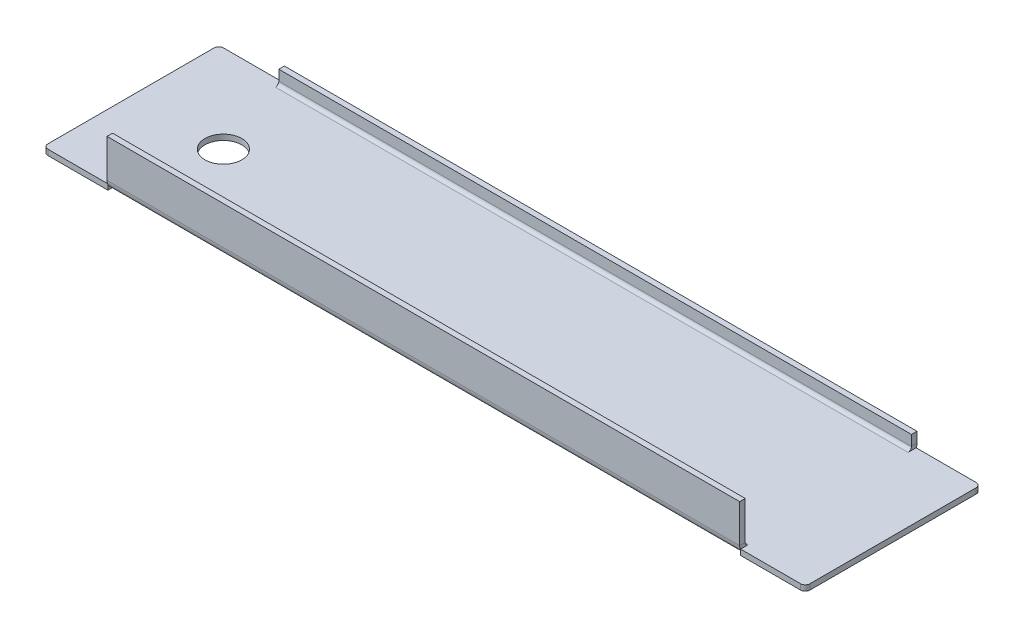
ISO-10303-21;
HEADER;
FILE_DESCRIPTION(('STEP AP214'),'2;1');
FILE_NAME('part.step','',(''),(''),'','','');
FILE_SCHEMA(('AUTOMOTIVE_DESIGN { 1 0 10303 214 1 1 1 1 }'));
ENDSEC;
DATA;
#1=APPLICATION_CONTEXT('core data for automotive mechanical design processes');
#2=APPLICATION_PROTOCOL_DEFINITION('international standard','automotive_design',2000,#1);
#3=PRODUCT_CONTEXT('',#1,'mechanical');
#4=PRODUCT('Part','Part','',(#3));
#5=PRODUCT_RELATED_PRODUCT_CATEGORY('part','',(#4));
#6=PRODUCT_DEFINITION_FORMATION('','',#4);
#7=PRODUCT_DEFINITION_CONTEXT('part definition',#1,'design');
#8=PRODUCT_DEFINITION('design','',#6,#7);
#9=PRODUCT_DEFINITION_SHAPE('','',#8);
#10=(LENGTH_UNIT() NAMED_UNIT(*) SI_UNIT(.MILLI.,.METRE.));
#11=(NAMED_UNIT(*) PLANE_ANGLE_UNIT() SI_UNIT($,.RADIAN.));
#12=(NAMED_UNIT(*) SI_UNIT($,.STERADIAN.) SOLID_ANGLE_UNIT());
#13=UNCERTAINTY_MEASURE_WITH_UNIT(LENGTH_MEASURE(1.E-05),#10,'distance_accuracy_value','');
#14=(GEOMETRIC_REPRESENTATION_CONTEXT(3) GLOBAL_UNCERTAINTY_ASSIGNED_CONTEXT((#13)) GLOBAL_UNIT_ASSIGNED_CONTEXT((#10,
#11,#12)) REPRESENTATION_CONTEXT('',''));
#15=CARTESIAN_POINT('',(0.,0.,0.));
#16=DIRECTION('',(0.,0.,1.));
#17=DIRECTION('',(1.,0.,0.));
#18=AXIS2_PLACEMENT_3D('',#15,#16,#17);
#19=CARTESIAN_POINT('',(-68.5,0.7366,17.2634));
#20=DIRECTION('',(-1.,0.,0.));
#21=DIRECTION('',(0.,0.,1.));
#22=AXIS2_PLACEMENT_3D('',#19,#20,#21);
#23=PLANE('',#22);
#24=CARTESIAN_POINT('',(-68.5,0.7366,17.2634));
#25=DIRECTION('',(1.,0.,0.));
#26=DIRECTION('',(0.,0.,-1.));
#27=AXIS2_PLACEMENT_3D('',#24,#25,#26);
#28=CIRCLE('',#27,0.7366);
#29=CARTESIAN_POINT('',(-68.5,0.7366,18.));
#30=VERTEX_POINT('',#29);
#31=CARTESIAN_POINT('',(-68.5,0.,17.2634));
#32=VERTEX_POINT('',#31);
#33=EDGE_CURVE('E301',#30,#32,#28,.T.);
#34=ORIENTED_EDGE('',*,*,#33,.T.);
#35=DIRECTION('',(0.,0.,-1.));
#36=VECTOR('',#35,1.);
#37=CARTESIAN_POINT('',(-68.5,0.,19.));
#38=LINE('',#37,#36);
#39=CARTESIAN_POINT('',(-68.5,0.,19.));
#40=VERTEX_POINT('',#39);
#41=EDGE_CURVE('E239',#40,#32,#38,.T.);
#42=ORIENTED_EDGE('',*,*,#41,.F.);
#43=DIRECTION('',(0.,1.,0.));
#44=VECTOR('',#43,1.);
#45=CARTESIAN_POINT('',(-68.5,-1.2,19.));
#46=LINE('',#45,#44);
#47=CARTESIAN_POINT('',(-68.5,-0.120511427995214,19.));
#48=VERTEX_POINT('',#47);
#49=EDGE_CURVE('E218',#48,#40,#46,.T.);
#50=ORIENTED_EDGE('',*,*,#49,.F.);
#51=CARTESIAN_POINT('',(-68.5,0.7366,17.2634));
#52=DIRECTION('',(-1.,0.,0.));
#53=DIRECTION('',(0.,0.,1.));
#54=AXIS2_PLACEMENT_3D('',#51,#52,#53);
#55=CIRCLE('',#54,1.9366);
#56=CARTESIAN_POINT('',(-68.5,0.736600000000001,19.2));
#57=VERTEX_POINT('',#56);
#58=EDGE_CURVE('E304',#57,#48,#55,.F.);
#59=ORIENTED_EDGE('',*,*,#58,.F.);
#60=DIRECTION('',(0.,0.,-1.));
#61=VECTOR('',#60,1.);
#62=CARTESIAN_POINT('',(-68.5,0.7366,18.));
#63=LINE('',#62,#61);
#64=EDGE_CURVE('E314',#30,#57,#63,.F.);
#65=ORIENTED_EDGE('',*,*,#64,.F.);
#66=EDGE_LOOP('',(#34,#42,#50,#59,#65));
#67=FACE_BOUND('',#66,.T.);
#68=ADVANCED_FACE('F34',(#67),#23,.T.);
#69=CARTESIAN_POINT('',(-68.5,0.7366,-17.2634));
#70=DIRECTION('',(-1.,0.,0.));
#71=DIRECTION('',(0.,0.,1.));
#72=AXIS2_PLACEMENT_3D('',#69,#70,#71);
#73=PLANE('',#72);
#74=DIRECTION('',(0.,1.,0.));
#75=VECTOR('',#74,1.);
#76=CARTESIAN_POINT('',(-68.5,0.7366,-19.));
#77=LINE('',#76,#75);
#78=CARTESIAN_POINT('',(-68.5,-0.120511427995214,-19.));
#79=VERTEX_POINT('',#78);
#80=CARTESIAN_POINT('',(-68.5,0.,-19.));
#81=VERTEX_POINT('',#80);
#82=EDGE_CURVE('E380',#79,#81,#77,.T.);
#83=ORIENTED_EDGE('',*,*,#82,.T.);
#84=DIRECTION('',(0.,0.,1.));
#85=VECTOR('',#84,1.);
#86=CARTESIAN_POINT('',(-68.5,0.,-17.2634));
#87=LINE('',#86,#85);
#88=CARTESIAN_POINT('',(-68.5,0.,-17.2634));
#89=VERTEX_POINT('',#88);
#90=EDGE_CURVE('E383',#81,#89,#87,.T.);
#91=ORIENTED_EDGE('',*,*,#90,.T.);
#92=CARTESIAN_POINT('',(-68.5,0.7366,-17.2634));
#93=DIRECTION('',(1.,0.,0.));
#94=DIRECTION('',(0.,0.,-1.));
#95=AXIS2_PLACEMENT_3D('',#92,#93,#94);
#96=CIRCLE('',#95,0.7366);
#97=CARTESIAN_POINT('',(-68.5,0.7366,-18.));
#98=VERTEX_POINT('',#97);
#99=EDGE_CURVE('E283',#89,#98,#96,.T.);
#100=ORIENTED_EDGE('',*,*,#99,.T.);
#101=DIRECTION('',(0.,0.,1.));
#102=VECTOR('',#101,1.);
#103=CARTESIAN_POINT('',(-68.5,0.7366,-18.));
#104=LINE('',#103,#102);
#105=CARTESIAN_POINT('',(-68.5,0.736599999999998,-19.2));
#106=VERTEX_POINT('',#105);
#107=EDGE_CURVE('E295',#98,#106,#104,.F.);
#108=ORIENTED_EDGE('',*,*,#107,.T.);
#109=CARTESIAN_POINT('',(-68.5,0.7366,-17.2634));
#110=DIRECTION('',(-1.,0.,0.));
#111=DIRECTION('',(0.,0.,1.));
#112=AXIS2_PLACEMENT_3D('',#109,#110,#111);
#113=CIRCLE('',#112,1.9366);
#114=EDGE_CURVE('E289',#79,#106,#113,.F.);
#115=ORIENTED_EDGE('',*,*,#114,.F.);
#116=EDGE_LOOP('',(#83,#91,#100,#108,#115));
#117=FACE_BOUND('',#116,.T.);
#118=ADVANCED_FACE('F437',(#117),#73,.T.);
#119=CARTESIAN_POINT('',(68.5,0.7366,17.2634));
#120=DIRECTION('',(1.,0.,0.));
#121=DIRECTION('',(0.,0.,-1.));
#122=AXIS2_PLACEMENT_3D('',#119,#120,#121);
#123=PLANE('',#122);
#124=DIRECTION('',(0.,-1.,0.));
#125=VECTOR('',#124,1.);
#126=CARTESIAN_POINT('',(68.5,0.,19.));
#127=LINE('',#126,#125);
#128=CARTESIAN_POINT('',(68.5,0.,19.));
#129=VERTEX_POINT('',#128);
#130=CARTESIAN_POINT('',(68.5,-0.120511427995214,19.));
#131=VERTEX_POINT('',#130);
#132=EDGE_CURVE('E250',#129,#131,#127,.T.);
#133=ORIENTED_EDGE('',*,*,#132,.F.);
#134=DIRECTION('',(0.,0.,-1.));
#135=VECTOR('',#134,1.);
#136=CARTESIAN_POINT('',(68.5,0.,19.));
#137=LINE('',#136,#135);
#138=CARTESIAN_POINT('',(68.5,0.,17.2634));
#139=VERTEX_POINT('',#138);
#140=EDGE_CURVE('E263',#129,#139,#137,.T.);
#141=ORIENTED_EDGE('',*,*,#140,.T.);
#142=CARTESIAN_POINT('',(68.5,0.7366,17.2634));
#143=DIRECTION('',(-1.,0.,0.));
#144=DIRECTION('',(0.,0.,1.));
#145=AXIS2_PLACEMENT_3D('',#142,#143,#144);
#146=CIRCLE('',#145,0.7366);
#147=CARTESIAN_POINT('',(68.5,0.7366,18.));
#148=VERTEX_POINT('',#147);
#149=EDGE_CURVE('E320',#139,#148,#146,.T.);
#150=ORIENTED_EDGE('',*,*,#149,.T.);
#151=DIRECTION('',(0.,0.,1.));
#152=VECTOR('',#151,1.);
#153=CARTESIAN_POINT('',(68.5,0.7366,19.2));
#154=LINE('',#153,#152);
#155=CARTESIAN_POINT('',(68.5,0.7366,19.2));
#156=VERTEX_POINT('',#155);
#157=EDGE_CURVE('E329',#156,#148,#154,.F.);
#158=ORIENTED_EDGE('',*,*,#157,.F.);
#159=CARTESIAN_POINT('',(68.5,0.7366,17.2634));
#160=DIRECTION('',(-1.,0.,0.));
#161=DIRECTION('',(0.,0.,1.));
#162=AXIS2_PLACEMENT_3D('',#159,#160,#161);
#163=CIRCLE('',#162,1.9366);
#164=EDGE_CURVE('E317',#131,#156,#163,.T.);
#165=ORIENTED_EDGE('',*,*,#164,.F.);
#166=EDGE_LOOP('',(#133,#141,#150,#158,#165));
#167=FACE_BOUND('',#166,.T.);
#168=ADVANCED_FACE('F443',(#167),#123,.T.);
#169=CARTESIAN_POINT('',(68.5,0.7366,-17.2634));
#170=DIRECTION('',(1.,0.,0.));
#171=DIRECTION('',(0.,0.,-1.));
#172=AXIS2_PLACEMENT_3D('',#169,#170,#171);
#173=PLANE('',#172);
#174=CARTESIAN_POINT('',(68.5,0.7366,-17.2634));
#175=DIRECTION('',(-1.,0.,0.));
#176=DIRECTION('',(0.,0.,1.));
#177=AXIS2_PLACEMENT_3D('',#174,#175,#176);
#178=CIRCLE('',#177,0.7366);
#179=CARTESIAN_POINT('',(68.5,0.736599999999999,-18.));
#180=VERTEX_POINT('',#179);
#181=CARTESIAN_POINT('',(68.5,0.,-17.2634));
#182=VERTEX_POINT('',#181);
#183=EDGE_CURVE('E269',#180,#182,#178,.T.);
#184=ORIENTED_EDGE('',*,*,#183,.T.);
#185=CARTESIAN_POINT('',(68.5,0.,-19.));
#186=VERTEX_POINT('',#185);
#187=EDGE_CURVE('E262',#182,#186,#137,.T.);
#188=ORIENTED_EDGE('',*,*,#187,.T.);
#189=DIRECTION('',(0.,-1.,0.));
#190=VECTOR('',#189,1.);
#191=CARTESIAN_POINT('',(68.5,0.,-19.));
#192=LINE('',#191,#190);
#193=CARTESIAN_POINT('',(68.5,-0.120511427995214,-19.));
#194=VERTEX_POINT('',#193);
#195=EDGE_CURVE('E247',#186,#194,#192,.T.);
#196=ORIENTED_EDGE('',*,*,#195,.T.);
#197=CARTESIAN_POINT('',(68.5,0.7366,-17.2634));
#198=DIRECTION('',(-1.,0.,0.));
#199=DIRECTION('',(0.,0.,1.));
#200=AXIS2_PLACEMENT_3D('',#197,#198,#199);
#201=CIRCLE('',#200,1.9366);
#202=CARTESIAN_POINT('',(68.5,0.736599999999998,-19.2));
#203=VERTEX_POINT('',#202);
#204=EDGE_CURVE('E268',#203,#194,#201,.T.);
#205=ORIENTED_EDGE('',*,*,#204,.F.);
#206=DIRECTION('',(0.,0.,-1.));
#207=VECTOR('',#206,1.);
#208=CARTESIAN_POINT('',(68.5,0.736599999999998,-19.2));
#209=LINE('',#208,#207);
#210=EDGE_CURVE('E280',#203,#180,#209,.F.);
#211=ORIENTED_EDGE('',*,*,#210,.T.);
#212=EDGE_LOOP('',(#184,#188,#196,#205,#211));
#213=FACE_BOUND('',#212,.T.);
#214=ADVANCED_FACE('F456',(#213),#173,.T.);
#215=CARTESIAN_POINT('',(82.5,0.,-19.2));
#216=DIRECTION('',(0.,0.,1.));
#217=DIRECTION('',(0.,-1.,0.));
#218=AXIS2_PLACEMENT_3D('',#215,#216,#217);
#219=PLANE('',#218);
#220=DIRECTION('',(0.,-1.,0.));
#221=VECTOR('',#220,1.);
#222=CARTESIAN_POINT('',(68.5,0.,-19.2));
#223=LINE('',#222,#221);
#224=CARTESIAN_POINT('',(68.5,3.,-19.2));
#225=VERTEX_POINT('',#224);
#226=EDGE_CURVE('E272',#225,#203,#223,.T.);
#227=ORIENTED_EDGE('',*,*,#226,.T.);
#228=DIRECTION('',(-1.,0.,0.));
#229=VECTOR('',#228,1.);
#230=CARTESIAN_POINT('',(82.5,0.736599999999998,-19.2));
#231=LINE('',#230,#229);
#232=EDGE_CURVE('E345',#203,#106,#231,.T.);
#233=ORIENTED_EDGE('',*,*,#232,.T.);
#234=DIRECTION('',(0.,-1.,0.));
#235=VECTOR('',#234,1.);
#236=CARTESIAN_POINT('',(-68.5,0.,-19.2));
#237=LINE('',#236,#235);
#238=CARTESIAN_POINT('',(-68.5,3.,-19.2));
#239=VERTEX_POINT('',#238);
#240=EDGE_CURVE('E292',#106,#239,#237,.F.);
#241=ORIENTED_EDGE('',*,*,#240,.T.);
#242=DIRECTION('',(-1.,0.,0.));
#243=VECTOR('',#242,1.);
#244=CARTESIAN_POINT('',(82.5,3.,-19.2));
#245=LINE('',#244,#243);
#246=EDGE_CURVE('E378',#225,#239,#245,.T.);
#247=ORIENTED_EDGE('',*,*,#246,.F.);
#248=EDGE_LOOP('',(#227,#233,#241,#247));
#249=FACE_BOUND('',#248,.T.);
#250=ADVANCED_FACE('F503',(#249),#219,.F.);
#251=CARTESIAN_POINT('',(82.5,3.,-18.));
#252=DIRECTION('',(0.,1.,0.));
#253=DIRECTION('',(0.,0.,1.));
#254=AXIS2_PLACEMENT_3D('',#251,#252,#253);
#255=PLANE('',#254);
#256=DIRECTION('',(-1.,0.,0.));
#257=VECTOR('',#256,1.);
#258=CARTESIAN_POINT('',(82.5,3.,-18.));
#259=LINE('',#258,#257);
#260=CARTESIAN_POINT('',(68.5,3.,-18.));
#261=VERTEX_POINT('',#260);
#262=CARTESIAN_POINT('',(-68.5,3.,-18.));
#263=VERTEX_POINT('',#262);
#264=EDGE_CURVE('E376',#261,#263,#259,.T.);
#265=ORIENTED_EDGE('',*,*,#264,.F.);
#266=DIRECTION('',(0.,0.,-1.));
#267=VECTOR('',#266,1.);
#268=CARTESIAN_POINT('',(68.5,3.,-19.2));
#269=LINE('',#268,#267);
#270=EDGE_CURVE('E277',#225,#261,#269,.F.);
#271=ORIENTED_EDGE('',*,*,#270,.F.);
#272=ORIENTED_EDGE('',*,*,#246,.T.);
#273=DIRECTION('',(0.,0.,1.));
#274=VECTOR('',#273,1.);
#275=CARTESIAN_POINT('',(-68.5,3.,-18.));
#276=LINE('',#275,#274);
#277=EDGE_CURVE('E298',#263,#239,#276,.F.);
#278=ORIENTED_EDGE('',*,*,#277,.F.);
#279=EDGE_LOOP('',(#265,#271,#272,#278));
#280=FACE_BOUND('',#279,.T.);
#281=ADVANCED_FACE('F499',(#280),#255,.T.);
#282=CARTESIAN_POINT('',(82.5,0.,-18.));
#283=DIRECTION('',(0.,0.,1.));
#284=DIRECTION('',(0.,-1.,0.));
#285=AXIS2_PLACEMENT_3D('',#282,#283,#284);
#286=PLANE('',#285);
#287=DIRECTION('',(-1.,0.,0.));
#288=VECTOR('',#287,1.);
#289=CARTESIAN_POINT('',(82.5,0.736599999999999,-18.));
#290=LINE('',#289,#288);
#291=EDGE_CURVE('E374',#180,#98,#290,.T.);
#292=ORIENTED_EDGE('',*,*,#291,.F.);
#293=DIRECTION('',(0.,-1.,0.));
#294=VECTOR('',#293,1.);
#295=CARTESIAN_POINT('',(68.5,0.,-18.));
#296=LINE('',#295,#294);
#297=EDGE_CURVE('E275',#261,#180,#296,.T.);
#298=ORIENTED_EDGE('',*,*,#297,.F.);
#299=ORIENTED_EDGE('',*,*,#264,.T.);
#300=DIRECTION('',(0.,1.,0.));
#301=VECTOR('',#300,1.);
#302=CARTESIAN_POINT('',(-68.5,0.,-18.));
#303=LINE('',#302,#301);
#304=EDGE_CURVE('E288',#98,#263,#303,.T.);
#305=ORIENTED_EDGE('',*,*,#304,.F.);
#306=EDGE_LOOP('',(#292,#298,#299,#305));
#307=FACE_BOUND('',#306,.T.);
#308=ADVANCED_FACE('F495',(#307),#286,.T.);
#309=CARTESIAN_POINT('',(82.5,0.7366,-17.2634));
#310=DIRECTION('',(-1.,0.,0.));
#311=DIRECTION('',(0.,0.,1.));
#312=AXIS2_PLACEMENT_3D('',#309,#310,#311);
#313=CYLINDRICAL_SURFACE('',#312,0.7366);
#314=DIRECTION('',(-1.,0.,0.));
#315=VECTOR('',#314,1.);
#316=CARTESIAN_POINT('',(82.5,0.,-17.2634));
#317=LINE('',#316,#315);
#318=EDGE_CURVE('E371',#182,#89,#317,.T.);
#319=ORIENTED_EDGE('',*,*,#318,.F.);
#320=ORIENTED_EDGE('',*,*,#183,.F.);
#321=ORIENTED_EDGE('',*,*,#291,.T.);
#322=ORIENTED_EDGE('',*,*,#99,.F.);
#323=EDGE_LOOP('',(#319,#320,#321,#322));
#324=FACE_BOUND('',#323,.T.);
#325=ADVANCED_FACE('F465',(#324),#313,.F.);
#326=CARTESIAN_POINT('',(82.5,0.7366,-17.2634));
#327=DIRECTION('',(-1.,0.,0.));
#328=DIRECTION('',(0.,0.,1.));
#329=AXIS2_PLACEMENT_3D('',#326,#327,#328);
#330=CYLINDRICAL_SURFACE('',#329,1.9366);
#331=ORIENTED_EDGE('',*,*,#204,.T.);
#332=CARTESIAN_POINT('',(68.5,0.7366,-17.2634));
#333=DIRECTION('',(1.,0.,0.));
#334=DIRECTION('',(0.,0.,-1.));
#335=AXIS2_PLACEMENT_3D('',#332,#333,#334);
#336=CIRCLE('',#335,1.9366);
#337=CARTESIAN_POINT('',(68.5,-1.2,-17.2634));
#338=VERTEX_POINT('',#337);
#339=EDGE_CURVE('E266',#338,#194,#336,.T.);
#340=ORIENTED_EDGE('',*,*,#339,.F.);
#341=DIRECTION('',(-1.,0.,0.));
#342=VECTOR('',#341,1.);
#343=CARTESIAN_POINT('',(82.5,-1.2,-17.2634));
#344=LINE('',#343,#342);
#345=CARTESIAN_POINT('',(-68.5,-1.2,-17.2634));
#346=VERTEX_POINT('',#345);
#347=EDGE_CURVE('E352',#338,#346,#344,.T.);
#348=ORIENTED_EDGE('',*,*,#347,.T.);
#349=EDGE_CURVE('E285',#346,#79,#113,.F.);
#350=ORIENTED_EDGE('',*,*,#349,.T.);
#351=ORIENTED_EDGE('',*,*,#114,.T.);
#352=ORIENTED_EDGE('',*,*,#232,.F.);
#353=EDGE_LOOP('',(#331,#340,#348,#350,#351,#352));
#354=FACE_BOUND('',#353,.T.);
#355=ADVANCED_FACE('F461',(#354),#330,.T.);
#356=CARTESIAN_POINT('',(82.5,0.7366,17.2634));
#357=DIRECTION('',(-1.,0.,0.));
#358=DIRECTION('',(0.,0.,1.));
#359=AXIS2_PLACEMENT_3D('',#356,#357,#358);
#360=CYLINDRICAL_SURFACE('',#359,0.7366);
#361=DIRECTION('',(-1.,0.,0.));
#362=VECTOR('',#361,1.);
#363=CARTESIAN_POINT('',(82.5,0.,17.2634));
#364=LINE('',#363,#362);
#365=EDGE_CURVE('E368',#139,#32,#364,.T.);
#366=ORIENTED_EDGE('',*,*,#365,.T.);
#367=ORIENTED_EDGE('',*,*,#33,.F.);
#368=DIRECTION('',(-1.,0.,0.));
#369=VECTOR('',#368,1.);
#370=CARTESIAN_POINT('',(82.5,0.7366,18.));
#371=LINE('',#370,#369);
#372=EDGE_CURVE('E365',#148,#30,#371,.T.);
#373=ORIENTED_EDGE('',*,*,#372,.F.);
#374=ORIENTED_EDGE('',*,*,#149,.F.);
#375=EDGE_LOOP('',(#366,#367,#373,#374));
#376=FACE_BOUND('',#375,.T.);
#377=ADVANCED_FACE('F464',(#376),#360,.F.);
#378=CARTESIAN_POINT('',(82.5,9.,18.));
#379=DIRECTION('',(0.,0.,-1.));
#380=DIRECTION('',(-1.,0.,0.));
#381=AXIS2_PLACEMENT_3D('',#378,#379,#380);
#382=PLANE('',#381);
#383=ORIENTED_EDGE('',*,*,#372,.T.);
#384=DIRECTION('',(0.,-1.,0.));
#385=VECTOR('',#384,1.);
#386=CARTESIAN_POINT('',(-68.5,9.,18.));
#387=LINE('',#386,#385);
#388=CARTESIAN_POINT('',(-68.5,9.,18.));
#389=VERTEX_POINT('',#388);
#390=EDGE_CURVE('E307',#389,#30,#387,.T.);
#391=ORIENTED_EDGE('',*,*,#390,.F.);
#392=DIRECTION('',(-1.,0.,0.));
#393=VECTOR('',#392,1.);
#394=CARTESIAN_POINT('',(82.5,9.,18.));
#395=LINE('',#394,#393);
#396=CARTESIAN_POINT('',(68.5,9.00000000000003,18.));
#397=VERTEX_POINT('',#396);
#398=EDGE_CURVE('E362',#397,#389,#395,.T.);
#399=ORIENTED_EDGE('',*,*,#398,.F.);
#400=DIRECTION('',(0.,1.,0.));
#401=VECTOR('',#400,1.);
#402=CARTESIAN_POINT('',(68.5,9.,18.));
#403=LINE('',#402,#401);
#404=EDGE_CURVE('E326',#397,#148,#403,.F.);
#405=ORIENTED_EDGE('',*,*,#404,.T.);
#406=EDGE_LOOP('',(#383,#391,#399,#405));
#407=FACE_BOUND('',#406,.T.);
#408=ADVANCED_FACE('F482',(#407),#382,.T.);
#409=CARTESIAN_POINT('',(82.5,9.,19.2));
#410=DIRECTION('',(0.,1.,0.));
#411=DIRECTION('',(0.,0.,1.));
#412=AXIS2_PLACEMENT_3D('',#409,#410,#411);
#413=PLANE('',#412);
#414=ORIENTED_EDGE('',*,*,#398,.T.);
#415=DIRECTION('',(0.,0.,-1.));
#416=VECTOR('',#415,1.);
#417=CARTESIAN_POINT('',(-68.5,9.,18.));
#418=LINE('',#417,#416);
#419=CARTESIAN_POINT('',(-68.5,9.,19.2));
#420=VERTEX_POINT('',#419);
#421=EDGE_CURVE('E312',#389,#420,#418,.F.);
#422=ORIENTED_EDGE('',*,*,#421,.T.);
#423=DIRECTION('',(-1.,0.,0.));
#424=VECTOR('',#423,1.);
#425=CARTESIAN_POINT('',(82.5,9.,19.2));
#426=LINE('',#425,#424);
#427=CARTESIAN_POINT('',(68.5,9.00000000000003,19.2));
#428=VERTEX_POINT('',#427);
#429=EDGE_CURVE('E359',#428,#420,#426,.T.);
#430=ORIENTED_EDGE('',*,*,#429,.F.);
#431=DIRECTION('',(0.,0.,1.));
#432=VECTOR('',#431,1.);
#433=CARTESIAN_POINT('',(68.5,9.00000000000003,19.2));
#434=LINE('',#433,#432);
#435=EDGE_CURVE('E332',#428,#397,#434,.F.);
#436=ORIENTED_EDGE('',*,*,#435,.T.);
#437=EDGE_LOOP('',(#414,#422,#430,#436));
#438=FACE_BOUND('',#437,.T.);
#439=ADVANCED_FACE('F478',(#438),#413,.T.);
#440=CARTESIAN_POINT('',(82.5,9.,19.2));
#441=DIRECTION('',(0.,0.,-1.));
#442=DIRECTION('',(-1.,0.,0.));
#443=AXIS2_PLACEMENT_3D('',#440,#441,#442);
#444=PLANE('',#443);
#445=DIRECTION('',(0.,1.,0.));
#446=VECTOR('',#445,1.);
#447=CARTESIAN_POINT('',(-68.5,9.,19.2));
#448=LINE('',#447,#446);
#449=EDGE_CURVE('E309',#420,#57,#448,.F.);
#450=ORIENTED_EDGE('',*,*,#449,.T.);
#451=DIRECTION('',(-1.,0.,0.));
#452=VECTOR('',#451,1.);
#453=CARTESIAN_POINT('',(82.5,0.7366,19.2));
#454=LINE('',#453,#452);
#455=EDGE_CURVE('E356',#156,#57,#454,.T.);
#456=ORIENTED_EDGE('',*,*,#455,.F.);
#457=DIRECTION('',(0.,-1.,0.));
#458=VECTOR('',#457,1.);
#459=CARTESIAN_POINT('',(68.5,0.,19.2));
#460=LINE('',#459,#458);
#461=EDGE_CURVE('E322',#428,#156,#460,.T.);
#462=ORIENTED_EDGE('',*,*,#461,.F.);
#463=ORIENTED_EDGE('',*,*,#429,.T.);
#464=EDGE_LOOP('',(#450,#456,#462,#463));
#465=FACE_BOUND('',#464,.T.);
#466=ADVANCED_FACE('F474',(#465),#444,.F.);
#467=CARTESIAN_POINT('',(82.5,0.7366,17.2634));
#468=DIRECTION('',(-1.,0.,0.));
#469=DIRECTION('',(0.,0.,1.));
#470=AXIS2_PLACEMENT_3D('',#467,#468,#469);
#471=CYLINDRICAL_SURFACE('',#470,1.9366);
#472=ORIENTED_EDGE('',*,*,#58,.T.);
#473=CARTESIAN_POINT('',(-68.5,0.7366,17.2634));
#474=DIRECTION('',(-1.,0.,0.));
#475=DIRECTION('',(0.,-1.,0.));
#476=AXIS2_PLACEMENT_3D('',#473,#474,#475);
#477=CIRCLE('',#476,1.9366);
#478=CARTESIAN_POINT('',(-68.5,-1.2,17.2634));
#479=VERTEX_POINT('',#478);
#480=EDGE_CURVE('E226',#479,#48,#477,.T.);
#481=ORIENTED_EDGE('',*,*,#480,.F.);
#482=DIRECTION('',(-1.,0.,0.));
#483=VECTOR('',#482,1.);
#484=CARTESIAN_POINT('',(82.5,-1.2,17.2634));
#485=LINE('',#484,#483);
#486=CARTESIAN_POINT('',(68.5,-1.2,17.2634));
#487=VERTEX_POINT('',#486);
#488=EDGE_CURVE('E233',#487,#479,#485,.T.);
#489=ORIENTED_EDGE('',*,*,#488,.F.);
#490=EDGE_CURVE('E323',#487,#131,#163,.T.);
#491=ORIENTED_EDGE('',*,*,#490,.T.);
#492=ORIENTED_EDGE('',*,*,#164,.T.);
#493=ORIENTED_EDGE('',*,*,#455,.T.);
#494=EDGE_LOOP('',(#472,#481,#489,#491,#492,#493));
#495=FACE_BOUND('',#494,.T.);
#496=ADVANCED_FACE('F470',(#495),#471,.T.);
#497=CARTESIAN_POINT('',(82.5,0.7366,19.2));
#498=DIRECTION('',(1.,0.,0.));
#499=DIRECTION('',(0.,0.,-1.));
#500=AXIS2_PLACEMENT_3D('',#497,#498,#499);
#501=PLANE('',#500);
#502=DIRECTION('',(0.,0.,-1.));
#503=VECTOR('',#502,1.);
#504=CARTESIAN_POINT('',(82.5,0.,18.));
#505=LINE('',#504,#503);
#506=CARTESIAN_POINT('',(82.5,0.,18.));
#507=VERTEX_POINT('',#506);
#508=CARTESIAN_POINT('',(82.5,0.,-18.));
#509=VERTEX_POINT('',#508);
#510=EDGE_CURVE('E338',#507,#509,#505,.T.);
#511=ORIENTED_EDGE('',*,*,#510,.F.);
#512=DIRECTION('',(0.,1.,0.));
#513=VECTOR('',#512,1.);
#514=CARTESIAN_POINT('',(82.5,0.7366,18.));
#515=LINE('',#514,#513);
#516=CARTESIAN_POINT('',(82.5,-1.2,18.));
#517=VERTEX_POINT('',#516);
#518=EDGE_CURVE('E399',#507,#517,#515,.F.);
#519=ORIENTED_EDGE('',*,*,#518,.T.);
#520=DIRECTION('',(0.,0.,-1.));
#521=VECTOR('',#520,1.);
#522=CARTESIAN_POINT('',(82.5,-1.2,18.));
#523=LINE('',#522,#521);
#524=CARTESIAN_POINT('',(82.5,-1.2,-18.));
#525=VERTEX_POINT('',#524);
#526=EDGE_CURVE('E341',#517,#525,#523,.T.);
#527=ORIENTED_EDGE('',*,*,#526,.T.);
#528=DIRECTION('',(0.,1.,0.));
#529=VECTOR('',#528,1.);
#530=CARTESIAN_POINT('',(82.5,0.,-18.));
#531=LINE('',#530,#529);
#532=EDGE_CURVE('E396',#525,#509,#531,.T.);
#533=ORIENTED_EDGE('',*,*,#532,.T.);
#534=EDGE_LOOP('',(#511,#519,#527,#533));
#535=FACE_BOUND('',#534,.T.);
#536=ADVANCED_FACE('F473',(#535),#501,.T.);
#537=CARTESIAN_POINT('',(-82.5,0.736599999999998,-19.2));
#538=DIRECTION('',(-1.,0.,0.));
#539=DIRECTION('',(0.,0.,1.));
#540=AXIS2_PLACEMENT_3D('',#537,#538,#539);
#541=PLANE('',#540);
#542=DIRECTION('',(0.,0.,-1.));
#543=VECTOR('',#542,1.);
#544=CARTESIAN_POINT('',(-82.5,-1.2,18.));
#545=LINE('',#544,#543);
#546=CARTESIAN_POINT('',(-82.5,-1.2,18.));
#547=VERTEX_POINT('',#546);
#548=CARTESIAN_POINT('',(-82.5,-1.2,-18.));
#549=VERTEX_POINT('',#548);
#550=EDGE_CURVE('E342',#547,#549,#545,.T.);
#551=ORIENTED_EDGE('',*,*,#550,.F.);
#552=DIRECTION('',(0.,-1.,0.));
#553=VECTOR('',#552,1.);
#554=CARTESIAN_POINT('',(-82.5,0.736599999999998,18.));
#555=LINE('',#554,#553);
#556=CARTESIAN_POINT('',(-82.5,0.,18.));
#557=VERTEX_POINT('',#556);
#558=EDGE_CURVE('E42',#547,#557,#555,.F.);
#559=ORIENTED_EDGE('',*,*,#558,.T.);
#560=DIRECTION('',(0.,0.,-1.));
#561=VECTOR('',#560,1.);
#562=CARTESIAN_POINT('',(-82.5,0.,18.));
#563=LINE('',#562,#561);
#564=CARTESIAN_POINT('',(-82.5,0.,-18.));
#565=VERTEX_POINT('',#564);
#566=EDGE_CURVE('E335',#557,#565,#563,.T.);
#567=ORIENTED_EDGE('',*,*,#566,.T.);
#568=DIRECTION('',(0.,-1.,0.));
#569=VECTOR('',#568,1.);
#570=CARTESIAN_POINT('',(-82.5,-1.2,-18.));
#571=LINE('',#570,#569);
#572=EDGE_CURVE('E410',#565,#549,#571,.T.);
#573=ORIENTED_EDGE('',*,*,#572,.T.);
#574=EDGE_LOOP('',(#551,#559,#567,#573));
#575=FACE_BOUND('',#574,.T.);
#576=ADVANCED_FACE('F415',(#575),#541,.T.);
#577=CARTESIAN_POINT('',(82.5,0.,18.));
#578=DIRECTION('',(0.,1.,0.));
#579=DIRECTION('',(0.,0.,1.));
#580=AXIS2_PLACEMENT_3D('',#577,#578,#579);
#581=PLANE('',#580);
#582=CARTESIAN_POINT('',(-62.5,0.,0.));
#583=DIRECTION('',(0.,1.,0.));
#584=DIRECTION('',(0.,0.,1.));
#585=AXIS2_PLACEMENT_3D('',#582,#583,#584);
#586=CIRCLE('',#585,4.00000000000001);
#587=CARTESIAN_POINT('',(-62.5,0.,4.00000000000001));
#588=VERTEX_POINT('',#587);
#589=EDGE_CURVE('E546',#588,#588,#586,.T.);
#590=ORIENTED_EDGE('',*,*,#589,.F.);
#591=EDGE_LOOP('',(#590));
#592=FACE_BOUND('',#591,.T.);
#593=DIRECTION('',(-1.,0.,0.));
#594=VECTOR('',#593,1.);
#595=CARTESIAN_POINT('',(82.5,0.,19.));
#596=LINE('',#595,#594);
#597=CARTESIAN_POINT('',(81.5,0.,19.));
#598=VERTEX_POINT('',#597);
#599=EDGE_CURVE('E246',#598,#129,#596,.T.);
#600=ORIENTED_EDGE('',*,*,#599,.F.);
#601=CARTESIAN_POINT('',(81.5,0.,18.));
#602=DIRECTION('',(0.,1.,0.));
#603=DIRECTION('',(0.,0.,1.));
#604=AXIS2_PLACEMENT_3D('',#601,#602,#603);
#605=CIRCLE('',#604,1.);
#606=EDGE_CURVE('E394',#598,#507,#605,.T.);
#607=ORIENTED_EDGE('',*,*,#606,.T.);
#608=ORIENTED_EDGE('',*,*,#510,.T.);
#609=CARTESIAN_POINT('',(81.5,0.,-18.));
#610=DIRECTION('',(0.,1.,0.));
#611=DIRECTION('',(0.,0.,1.));
#612=AXIS2_PLACEMENT_3D('',#609,#610,#611);
#613=CIRCLE('',#612,1.);
#614=CARTESIAN_POINT('',(81.5,0.,-19.));
#615=VERTEX_POINT('',#614);
#616=EDGE_CURVE('E392',#509,#615,#613,.T.);
#617=ORIENTED_EDGE('',*,*,#616,.T.);
#618=DIRECTION('',(-1.,0.,0.));
#619=VECTOR('',#618,1.);
#620=CARTESIAN_POINT('',(82.5,0.,-19.));
#621=LINE('',#620,#619);
#622=EDGE_CURVE('E255',#615,#186,#621,.T.);
#623=ORIENTED_EDGE('',*,*,#622,.T.);
#624=ORIENTED_EDGE('',*,*,#187,.F.);
#625=ORIENTED_EDGE('',*,*,#318,.T.);
#626=ORIENTED_EDGE('',*,*,#90,.F.);
#627=DIRECTION('',(-1.,0.,0.));
#628=VECTOR('',#627,1.);
#629=CARTESIAN_POINT('',(-68.5,0.,-19.));
#630=LINE('',#629,#628);
#631=CARTESIAN_POINT('',(-81.5,0.,-19.));
#632=VERTEX_POINT('',#631);
#633=EDGE_CURVE('E219',#81,#632,#630,.T.);
#634=ORIENTED_EDGE('',*,*,#633,.T.);
#635=CARTESIAN_POINT('',(-81.5,0.,-18.));
#636=DIRECTION('',(0.,1.,0.));
#637=DIRECTION('',(0.,0.,1.));
#638=AXIS2_PLACEMENT_3D('',#635,#636,#637);
#639=CIRCLE('',#638,1.);
#640=EDGE_CURVE('E388',#632,#565,#639,.T.);
#641=ORIENTED_EDGE('',*,*,#640,.T.);
#642=ORIENTED_EDGE('',*,*,#566,.F.);
#643=CARTESIAN_POINT('',(-81.5,0.,18.));
#644=DIRECTION('',(0.,1.,0.));
#645=DIRECTION('',(0.,0.,1.));
#646=AXIS2_PLACEMENT_3D('',#643,#644,#645);
#647=CIRCLE('',#646,1.);
#648=CARTESIAN_POINT('',(-81.5,0.,19.));
#649=VERTEX_POINT('',#648);
#650=EDGE_CURVE('E390',#557,#649,#647,.T.);
#651=ORIENTED_EDGE('',*,*,#650,.T.);
#652=DIRECTION('',(-1.,0.,0.));
#653=VECTOR('',#652,1.);
#654=CARTESIAN_POINT('',(-68.5,0.,19.));
#655=LINE('',#654,#653);
#656=EDGE_CURVE('E227',#40,#649,#655,.T.);
#657=ORIENTED_EDGE('',*,*,#656,.F.);
#658=ORIENTED_EDGE('',*,*,#41,.T.);
#659=ORIENTED_EDGE('',*,*,#365,.F.);
#660=ORIENTED_EDGE('',*,*,#140,.F.);
#661=EDGE_LOOP('',(#600,#607,#608,#617,#623,#624,#625,#626,#634,#641,#642,#651,#657,#658,#659,#660));
#662=FACE_BOUND('',#661,.T.);
#663=ADVANCED_FACE('F420',(#592,#662),#581,.T.);
#664=CARTESIAN_POINT('',(82.5,-1.2,18.));
#665=DIRECTION('',(0.,1.,0.));
#666=DIRECTION('',(0.,0.,1.));
#667=AXIS2_PLACEMENT_3D('',#664,#665,#666);
#668=PLANE('',#667);
#669=CARTESIAN_POINT('',(-62.5,-1.2,0.));
#670=DIRECTION('',(0.,-1.,0.));
#671=DIRECTION('',(0.,0.,-1.));
#672=AXIS2_PLACEMENT_3D('',#669,#670,#671);
#673=CIRCLE('',#672,4.00000000000001);
#674=CARTESIAN_POINT('',(-62.5,-1.2,-4.00000000000001));
#675=VERTEX_POINT('',#674);
#676=EDGE_CURVE('E782',#675,#675,#673,.T.);
#677=ORIENTED_EDGE('',*,*,#676,.F.);
#678=EDGE_LOOP('',(#677));
#679=FACE_BOUND('',#678,.T.);
#680=ORIENTED_EDGE('',*,*,#526,.F.);
#681=CARTESIAN_POINT('',(81.5,-1.2,18.));
#682=DIRECTION('',(0.,1.,0.));
#683=DIRECTION('',(0.,0.,1.));
#684=AXIS2_PLACEMENT_3D('',#681,#682,#683);
#685=CIRCLE('',#684,1.);
#686=CARTESIAN_POINT('',(81.5,-1.2,19.));
#687=VERTEX_POINT('',#686);
#688=EDGE_CURVE('E406',#517,#687,#685,.F.);
#689=ORIENTED_EDGE('',*,*,#688,.T.);
#690=DIRECTION('',(1.,0.,0.));
#691=VECTOR('',#690,1.);
#692=CARTESIAN_POINT('',(68.5,-1.2,19.));
#693=LINE('',#692,#691);
#694=CARTESIAN_POINT('',(68.5,-1.2,19.));
#695=VERTEX_POINT('',#694);
#696=EDGE_CURVE('E243',#695,#687,#693,.T.);
#697=ORIENTED_EDGE('',*,*,#696,.F.);
#698=DIRECTION('',(0.,0.,-1.));
#699=VECTOR('',#698,1.);
#700=CARTESIAN_POINT('',(68.5,-1.2,19.));
#701=LINE('',#700,#699);
#702=EDGE_CURVE('E260',#695,#487,#701,.T.);
#703=ORIENTED_EDGE('',*,*,#702,.T.);
#704=ORIENTED_EDGE('',*,*,#488,.T.);
#705=DIRECTION('',(0.,0.,-1.));
#706=VECTOR('',#705,1.);
#707=CARTESIAN_POINT('',(-68.5,-1.2,19.));
#708=LINE('',#707,#706);
#709=CARTESIAN_POINT('',(-68.5,-1.2,19.));
#710=VERTEX_POINT('',#709);
#711=EDGE_CURVE('E225',#710,#479,#708,.T.);
#712=ORIENTED_EDGE('',*,*,#711,.F.);
#713=DIRECTION('',(1.,0.,0.));
#714=VECTOR('',#713,1.);
#715=CARTESIAN_POINT('',(-82.5,-1.2,19.));
#716=LINE('',#715,#714);
#717=CARTESIAN_POINT('',(-81.5,-1.2,19.));
#718=VERTEX_POINT('',#717);
#719=EDGE_CURVE('E209',#718,#710,#716,.T.);
#720=ORIENTED_EDGE('',*,*,#719,.F.);
#721=CARTESIAN_POINT('',(-81.5,-1.2,18.));
#722=DIRECTION('',(0.,1.,0.));
#723=DIRECTION('',(0.,0.,1.));
#724=AXIS2_PLACEMENT_3D('',#721,#722,#723);
#725=CIRCLE('',#724,1.);
#726=EDGE_CURVE('E49',#718,#547,#725,.F.);
#727=ORIENTED_EDGE('',*,*,#726,.T.);
#728=ORIENTED_EDGE('',*,*,#550,.T.);
#729=CARTESIAN_POINT('',(-81.5,-1.2,-18.));
#730=DIRECTION('',(0.,1.,0.));
#731=DIRECTION('',(0.,0.,1.));
#732=AXIS2_PLACEMENT_3D('',#729,#730,#731);
#733=CIRCLE('',#732,1.);
#734=CARTESIAN_POINT('',(-81.5,-1.2,-19.));
#735=VERTEX_POINT('',#734);
#736=EDGE_CURVE('E401',#549,#735,#733,.F.);
#737=ORIENTED_EDGE('',*,*,#736,.T.);
#738=DIRECTION('',(1.,0.,0.));
#739=VECTOR('',#738,1.);
#740=CARTESIAN_POINT('',(-82.5,-1.2,-19.));
#741=LINE('',#740,#739);
#742=CARTESIAN_POINT('',(-68.5,-1.2,-19.));
#743=VERTEX_POINT('',#742);
#744=EDGE_CURVE('E543',#735,#743,#741,.T.);
#745=ORIENTED_EDGE('',*,*,#744,.T.);
#746=EDGE_CURVE('E234',#346,#743,#708,.T.);
#747=ORIENTED_EDGE('',*,*,#746,.F.);
#748=ORIENTED_EDGE('',*,*,#347,.F.);
#749=CARTESIAN_POINT('',(68.5,-1.2,-19.));
#750=VERTEX_POINT('',#749);
#751=EDGE_CURVE('E253',#338,#750,#701,.T.);
#752=ORIENTED_EDGE('',*,*,#751,.T.);
#753=DIRECTION('',(1.,0.,0.));
#754=VECTOR('',#753,1.);
#755=CARTESIAN_POINT('',(68.5,-1.2,-19.));
#756=LINE('',#755,#754);
#757=CARTESIAN_POINT('',(81.5,-1.2,-19.));
#758=VERTEX_POINT('',#757);
#759=EDGE_CURVE('E236',#750,#758,#756,.T.);
#760=ORIENTED_EDGE('',*,*,#759,.T.);
#761=CARTESIAN_POINT('',(81.5,-1.2,-18.));
#762=DIRECTION('',(0.,1.,0.));
#763=DIRECTION('',(0.,0.,1.));
#764=AXIS2_PLACEMENT_3D('',#761,#762,#763);
#765=CIRCLE('',#764,1.);
#766=EDGE_CURVE('E404',#758,#525,#765,.F.);
#767=ORIENTED_EDGE('',*,*,#766,.T.);
#768=EDGE_LOOP('',(#680,#689,#697,#703,#704,#712,#720,#727,#728,#737,#745,#747,#748,#752,#760,#767));
#769=FACE_BOUND('',#768,.T.);
#770=ADVANCED_FACE('F231',(#679,#769),#668,.F.);
#771=CARTESIAN_POINT('',(68.5,0.,19.2));
#772=DIRECTION('',(1.,0.,0.));
#773=DIRECTION('',(0.,-1.,0.));
#774=AXIS2_PLACEMENT_3D('',#771,#772,#773);
#775=PLANE('',#774);
#776=ORIENTED_EDGE('',*,*,#435,.F.);
#777=ORIENTED_EDGE('',*,*,#461,.T.);
#778=ORIENTED_EDGE('',*,*,#157,.T.);
#779=ORIENTED_EDGE('',*,*,#404,.F.);
#780=EDGE_LOOP('',(#776,#777,#778,#779));
#781=FACE_BOUND('',#780,.T.);
#782=ADVANCED_FACE('F452',(#781),#775,.T.);
#783=CARTESIAN_POINT('',(-68.5,9.,18.));
#784=DIRECTION('',(1.,0.,0.));
#785=DIRECTION('',(0.,-1.,0.));
#786=AXIS2_PLACEMENT_3D('',#783,#784,#785);
#787=PLANE('',#786);
#788=ORIENTED_EDGE('',*,*,#390,.T.);
#789=ORIENTED_EDGE('',*,*,#64,.T.);
#790=ORIENTED_EDGE('',*,*,#449,.F.);
#791=ORIENTED_EDGE('',*,*,#421,.F.);
#792=EDGE_LOOP('',(#788,#789,#790,#791));
#793=FACE_BOUND('',#792,.T.);
#794=ADVANCED_FACE('F449',(#793),#787,.F.);
#795=CARTESIAN_POINT('',(-68.5,0.,-18.));
#796=DIRECTION('',(1.,0.,0.));
#797=DIRECTION('',(0.,1.,0.));
#798=AXIS2_PLACEMENT_3D('',#795,#796,#797);
#799=PLANE('',#798);
#800=ORIENTED_EDGE('',*,*,#304,.T.);
#801=ORIENTED_EDGE('',*,*,#277,.T.);
#802=ORIENTED_EDGE('',*,*,#240,.F.);
#803=ORIENTED_EDGE('',*,*,#107,.F.);
#804=EDGE_LOOP('',(#800,#801,#802,#803));
#805=FACE_BOUND('',#804,.T.);
#806=ADVANCED_FACE('F448',(#805),#799,.F.);
#807=CARTESIAN_POINT('',(68.5,0.,-19.2));
#808=DIRECTION('',(-1.,0.,0.));
#809=DIRECTION('',(0.,-1.,0.));
#810=AXIS2_PLACEMENT_3D('',#807,#808,#809);
#811=PLANE('',#810);
#812=ORIENTED_EDGE('',*,*,#210,.F.);
#813=ORIENTED_EDGE('',*,*,#226,.F.);
#814=ORIENTED_EDGE('',*,*,#270,.T.);
#815=ORIENTED_EDGE('',*,*,#297,.T.);
#816=EDGE_LOOP('',(#812,#813,#814,#815));
#817=FACE_BOUND('',#816,.T.);
#818=ADVANCED_FACE('F571',(#817),#811,.F.);
#819=CARTESIAN_POINT('',(82.5,-1.2,-19.));
#820=DIRECTION('',(0.,0.,1.));
#821=DIRECTION('',(1.,0.,0.));
#822=AXIS2_PLACEMENT_3D('',#819,#820,#821);
#823=PLANE('',#822);
#824=ORIENTED_EDGE('',*,*,#622,.F.);
#825=DIRECTION('',(0.,1.,0.));
#826=VECTOR('',#825,1.);
#827=CARTESIAN_POINT('',(81.5,-1.2,-19.));
#828=LINE('',#827,#826);
#829=EDGE_CURVE('E57',#615,#758,#828,.F.);
#830=ORIENTED_EDGE('',*,*,#829,.T.);
#831=ORIENTED_EDGE('',*,*,#759,.F.);
#832=EDGE_CURVE('E257',#194,#750,#192,.T.);
#833=ORIENTED_EDGE('',*,*,#832,.F.);
#834=ORIENTED_EDGE('',*,*,#195,.F.);
#835=EDGE_LOOP('',(#824,#830,#831,#833,#834));
#836=FACE_BOUND('',#835,.T.);
#837=ADVANCED_FACE('F569',(#836),#823,.F.);
#838=CARTESIAN_POINT('',(68.5,0.,19.));
#839=DIRECTION('',(1.,0.,0.));
#840=DIRECTION('',(0.,0.,-1.));
#841=AXIS2_PLACEMENT_3D('',#838,#839,#840);
#842=PLANE('',#841);
#843=ORIENTED_EDGE('',*,*,#751,.F.);
#844=ORIENTED_EDGE('',*,*,#339,.T.);
#845=ORIENTED_EDGE('',*,*,#832,.T.);
#846=EDGE_LOOP('',(#843,#844,#845));
#847=FACE_BOUND('',#846,.T.);
#848=ADVANCED_FACE('F567',(#847),#842,.F.);
#849=EDGE_CURVE('E249',#131,#695,#127,.T.);
#850=ORIENTED_EDGE('',*,*,#849,.F.);
#851=ORIENTED_EDGE('',*,*,#490,.F.);
#852=ORIENTED_EDGE('',*,*,#702,.F.);
#853=EDGE_LOOP('',(#850,#851,#852));
#854=FACE_BOUND('',#853,.T.);
#855=ADVANCED_FACE('F530',(#854),#842,.F.);
#856=CARTESIAN_POINT('',(82.5,-1.2,19.));
#857=DIRECTION('',(0.,0.,1.));
#858=DIRECTION('',(1.,0.,0.));
#859=AXIS2_PLACEMENT_3D('',#856,#857,#858);
#860=PLANE('',#859);
#861=ORIENTED_EDGE('',*,*,#696,.T.);
#862=DIRECTION('',(0.,1.,0.));
#863=VECTOR('',#862,1.);
#864=CARTESIAN_POINT('',(81.5,-1.2,19.));
#865=LINE('',#864,#863);
#866=EDGE_CURVE('E385',#687,#598,#865,.T.);
#867=ORIENTED_EDGE('',*,*,#866,.T.);
#868=ORIENTED_EDGE('',*,*,#599,.T.);
#869=ORIENTED_EDGE('',*,*,#132,.T.);
#870=ORIENTED_EDGE('',*,*,#849,.T.);
#871=EDGE_LOOP('',(#861,#867,#868,#869,#870));
#872=FACE_BOUND('',#871,.T.);
#873=ADVANCED_FACE('F524',(#872),#860,.T.);
#874=CARTESIAN_POINT('',(-68.5,-1.2,-19.));
#875=DIRECTION('',(0.,0.,1.));
#876=DIRECTION('',(1.,0.,0.));
#877=AXIS2_PLACEMENT_3D('',#874,#875,#876);
#878=PLANE('',#877);
#879=ORIENTED_EDGE('',*,*,#744,.F.);
#880=DIRECTION('',(0.,-1.,0.));
#881=VECTOR('',#880,1.);
#882=CARTESIAN_POINT('',(-81.5,0.,-19.));
#883=LINE('',#882,#881);
#884=EDGE_CURVE('E11',#735,#632,#883,.F.);
#885=ORIENTED_EDGE('',*,*,#884,.T.);
#886=ORIENTED_EDGE('',*,*,#633,.F.);
#887=ORIENTED_EDGE('',*,*,#82,.F.);
#888=DIRECTION('',(0.,1.,0.));
#889=VECTOR('',#888,1.);
#890=CARTESIAN_POINT('',(-68.5,-1.2,-19.));
#891=LINE('',#890,#889);
#892=EDGE_CURVE('E545',#743,#79,#891,.T.);
#893=ORIENTED_EDGE('',*,*,#892,.F.);
#894=EDGE_LOOP('',(#879,#885,#886,#887,#893));
#895=FACE_BOUND('',#894,.T.);
#896=ADVANCED_FACE('F554',(#895),#878,.F.);
#897=CARTESIAN_POINT('',(-68.5,-1.2,19.));
#898=DIRECTION('',(-1.,0.,0.));
#899=DIRECTION('',(0.,-1.,0.));
#900=AXIS2_PLACEMENT_3D('',#897,#898,#899);
#901=PLANE('',#900);
#902=ORIENTED_EDGE('',*,*,#892,.T.);
#903=ORIENTED_EDGE('',*,*,#349,.F.);
#904=ORIENTED_EDGE('',*,*,#746,.T.);
#905=EDGE_LOOP('',(#902,#903,#904));
#906=FACE_BOUND('',#905,.T.);
#907=ADVANCED_FACE('F557',(#906),#901,.F.);
#908=ORIENTED_EDGE('',*,*,#711,.T.);
#909=ORIENTED_EDGE('',*,*,#480,.T.);
#910=EDGE_CURVE('E214',#710,#48,#46,.T.);
#911=ORIENTED_EDGE('',*,*,#910,.F.);
#912=EDGE_LOOP('',(#908,#909,#911));
#913=FACE_BOUND('',#912,.T.);
#914=ADVANCED_FACE('F224',(#913),#901,.F.);
#915=CARTESIAN_POINT('',(-68.5,-1.2,19.));
#916=DIRECTION('',(0.,0.,1.));
#917=DIRECTION('',(1.,0.,0.));
#918=AXIS2_PLACEMENT_3D('',#915,#916,#917);
#919=PLANE('',#918);
#920=ORIENTED_EDGE('',*,*,#656,.T.);
#921=DIRECTION('',(0.,-1.,0.));
#922=VECTOR('',#921,1.);
#923=CARTESIAN_POINT('',(-81.5,-1.2,19.));
#924=LINE('',#923,#922);
#925=EDGE_CURVE('E215',#649,#718,#924,.T.);
#926=ORIENTED_EDGE('',*,*,#925,.T.);
#927=ORIENTED_EDGE('',*,*,#719,.T.);
#928=ORIENTED_EDGE('',*,*,#910,.T.);
#929=ORIENTED_EDGE('',*,*,#49,.T.);
#930=EDGE_LOOP('',(#920,#926,#927,#928,#929));
#931=FACE_BOUND('',#930,.T.);
#932=ADVANCED_FACE('F212',(#931),#919,.T.);
#933=CARTESIAN_POINT('',(81.5,-1.2,18.));
#934=DIRECTION('',(0.,1.,0.));
#935=DIRECTION('',(0.,0.,1.));
#936=AXIS2_PLACEMENT_3D('',#933,#934,#935);
#937=CYLINDRICAL_SURFACE('',#936,1.);
#938=ORIENTED_EDGE('',*,*,#688,.F.);
#939=ORIENTED_EDGE('',*,*,#518,.F.);
#940=ORIENTED_EDGE('',*,*,#606,.F.);
#941=ORIENTED_EDGE('',*,*,#866,.F.);
#942=EDGE_LOOP('',(#938,#939,#940,#941));
#943=FACE_BOUND('',#942,.T.);
#944=ADVANCED_FACE('F433',(#943),#937,.T.);
#945=CARTESIAN_POINT('',(81.5,0.7366,-18.));
#946=DIRECTION('',(0.,-1.,0.));
#947=DIRECTION('',(0.,0.,-1.));
#948=AXIS2_PLACEMENT_3D('',#945,#946,#947);
#949=CYLINDRICAL_SURFACE('',#948,1.);
#950=ORIENTED_EDGE('',*,*,#766,.F.);
#951=ORIENTED_EDGE('',*,*,#829,.F.);
#952=ORIENTED_EDGE('',*,*,#616,.F.);
#953=ORIENTED_EDGE('',*,*,#532,.F.);
#954=EDGE_LOOP('',(#950,#951,#952,#953));
#955=FACE_BOUND('',#954,.T.);
#956=ADVANCED_FACE('F426',(#955),#949,.T.);
#957=CARTESIAN_POINT('',(-81.5,-1.2,18.));
#958=DIRECTION('',(0.,-1.,0.));
#959=DIRECTION('',(0.,0.,-1.));
#960=AXIS2_PLACEMENT_3D('',#957,#958,#959);
#961=CYLINDRICAL_SURFACE('',#960,1.);
#962=ORIENTED_EDGE('',*,*,#650,.F.);
#963=ORIENTED_EDGE('',*,*,#558,.F.);
#964=ORIENTED_EDGE('',*,*,#726,.F.);
#965=ORIENTED_EDGE('',*,*,#925,.F.);
#966=EDGE_LOOP('',(#962,#963,#964,#965));
#967=FACE_BOUND('',#966,.T.);
#968=ADVANCED_FACE('F424',(#967),#961,.T.);
#969=CARTESIAN_POINT('',(-81.5,0.736599999999998,-18.));
#970=DIRECTION('',(0.,1.,0.));
#971=DIRECTION('',(0.,0.,1.));
#972=AXIS2_PLACEMENT_3D('',#969,#970,#971);
#973=CYLINDRICAL_SURFACE('',#972,1.);
#974=ORIENTED_EDGE('',*,*,#640,.F.);
#975=ORIENTED_EDGE('',*,*,#884,.F.);
#976=ORIENTED_EDGE('',*,*,#736,.F.);
#977=ORIENTED_EDGE('',*,*,#572,.F.);
#978=EDGE_LOOP('',(#974,#975,#976,#977));
#979=FACE_BOUND('',#978,.T.);
#980=ADVANCED_FACE('F36',(#979),#973,.T.);
#981=CARTESIAN_POINT('',(-62.5,9.00000000000003,0.));
#982=DIRECTION('',(0.,-1.,0.));
#983=DIRECTION('',(0.,0.,-1.));
#984=AXIS2_PLACEMENT_3D('',#981,#982,#983);
#985=CYLINDRICAL_SURFACE('',#984,4.00000000000001);
#986=ORIENTED_EDGE('',*,*,#589,.T.);
#987=EDGE_LOOP('',(#986));
#988=FACE_BOUND('',#987,.T.);
#989=ORIENTED_EDGE('',*,*,#676,.T.);
#990=EDGE_LOOP('',(#989));
#991=FACE_BOUND('',#990,.T.);
#992=ADVANCED_FACE('F431',(#988,#991),#985,.F.);
#993=CLOSED_SHELL('',(#68,#118,#168,#214,#250,#281,#308,#325,#355,#377,#408,#439,#466,#496,#536,
#576,#663,#770,#782,#794,#806,#818,#837,#848,#855,#873,#896,#907,#914,#932,#944,#956,#968,#980,#992));
#994=MANIFOLD_SOLID_BREP('B2',#993);
#995=ADVANCED_BREP_SHAPE_REPRESENTATION('',(#18,#994),#14);
#996=SHAPE_DEFINITION_REPRESENTATION(#9,#995);
ENDSEC;
END-ISO-10303-21;
